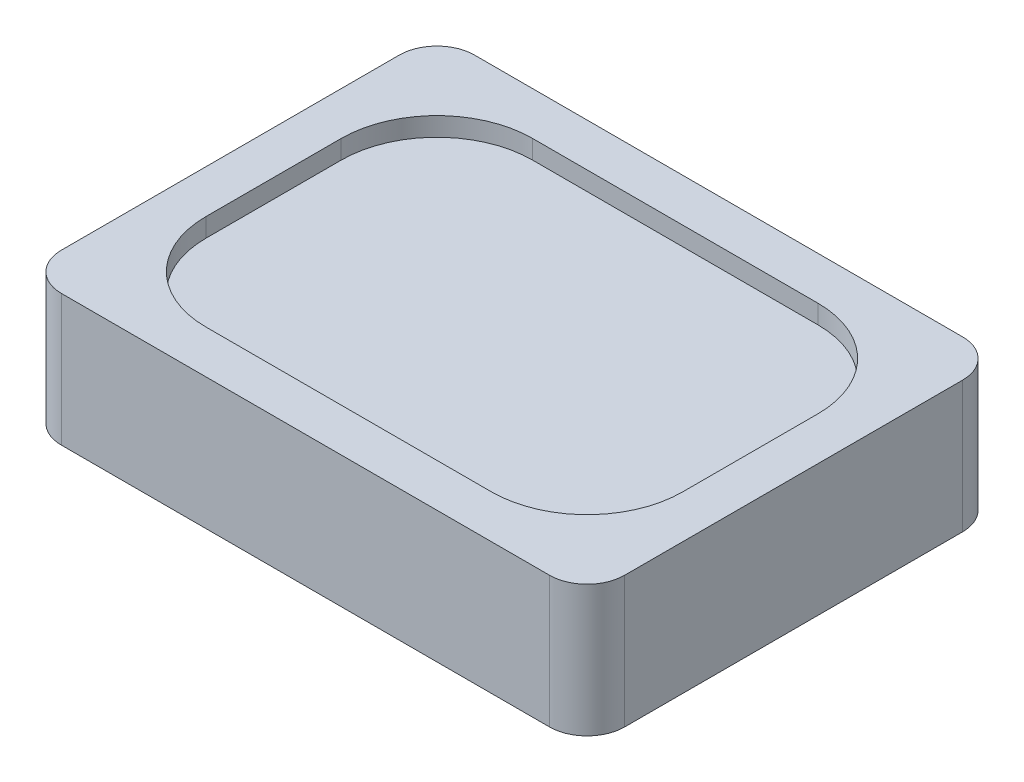
ISO-10303-21;
HEADER;
FILE_DESCRIPTION(('STEP AP214'),'2;1');
FILE_NAME('part.step','',(''),(''),'','','');
FILE_SCHEMA(('AUTOMOTIVE_DESIGN { 1 0 10303 214 1 1 1 1 }'));
ENDSEC;
DATA;
#1=APPLICATION_CONTEXT('core data for automotive mechanical design processes');
#2=APPLICATION_PROTOCOL_DEFINITION('international standard','automotive_design',2000,#1);
#3=PRODUCT_CONTEXT('',#1,'mechanical');
#4=PRODUCT('Part','Part','',(#3));
#5=PRODUCT_RELATED_PRODUCT_CATEGORY('part','',(#4));
#6=PRODUCT_DEFINITION_FORMATION('','',#4);
#7=PRODUCT_DEFINITION_CONTEXT('part definition',#1,'design');
#8=PRODUCT_DEFINITION('design','',#6,#7);
#9=PRODUCT_DEFINITION_SHAPE('','',#8);
#10=(LENGTH_UNIT() NAMED_UNIT(*) SI_UNIT(.MILLI.,.METRE.));
#11=(NAMED_UNIT(*) PLANE_ANGLE_UNIT() SI_UNIT($,.RADIAN.));
#12=(NAMED_UNIT(*) SI_UNIT($,.STERADIAN.) SOLID_ANGLE_UNIT());
#13=UNCERTAINTY_MEASURE_WITH_UNIT(LENGTH_MEASURE(1.E-05),#10,'distance_accuracy_value','');
#14=(GEOMETRIC_REPRESENTATION_CONTEXT(3) GLOBAL_UNCERTAINTY_ASSIGNED_CONTEXT((#13)) GLOBAL_UNIT_ASSIGNED_CONTEXT((#10,
#11,#12)) REPRESENTATION_CONTEXT('',''));
#15=CARTESIAN_POINT('',(0.,0.,0.));
#16=DIRECTION('',(0.,0.,1.));
#17=DIRECTION('',(1.,0.,0.));
#18=AXIS2_PLACEMENT_3D('',#15,#16,#17);
#19=CARTESIAN_POINT('',(7.5,3.5,5.50000000000001));
#20=DIRECTION('',(-1.,0.,0.));
#21=DIRECTION('',(0.,0.,1.));
#22=AXIS2_PLACEMENT_3D('',#19,#20,#21);
#23=PLANE('',#22);
#24=DIRECTION('',(0.,0.,-1.));
#25=VECTOR('',#24,1.);
#26=CARTESIAN_POINT('',(7.5,0.,5.50000000000001));
#27=LINE('',#26,#25);
#28=CARTESIAN_POINT('',(7.5,0.,4.50000000000001));
#29=VERTEX_POINT('',#28);
#30=CARTESIAN_POINT('',(7.5,0.,-4.49999999999999));
#31=VERTEX_POINT('',#30);
#32=EDGE_CURVE('E177',#29,#31,#27,.T.);
#33=ORIENTED_EDGE('',*,*,#32,.T.);
#34=DIRECTION('',(0.,-1.,0.));
#35=VECTOR('',#34,1.);
#36=CARTESIAN_POINT('',(7.5,3.5,-4.49999999999999));
#37=LINE('',#36,#35);
#38=CARTESIAN_POINT('',(7.5,3.5,-4.49999999999999));
#39=VERTEX_POINT('',#38);
#40=EDGE_CURVE('E201',#31,#39,#37,.F.);
#41=ORIENTED_EDGE('',*,*,#40,.T.);
#42=DIRECTION('',(0.,0.,-1.));
#43=VECTOR('',#42,1.);
#44=CARTESIAN_POINT('',(7.5,3.5,5.50000000000001));
#45=LINE('',#44,#43);
#46=CARTESIAN_POINT('',(7.5,3.5,4.50000000000001));
#47=VERTEX_POINT('',#46);
#48=EDGE_CURVE('E175',#47,#39,#45,.T.);
#49=ORIENTED_EDGE('',*,*,#48,.F.);
#50=DIRECTION('',(0.,-1.,0.));
#51=VECTOR('',#50,1.);
#52=CARTESIAN_POINT('',(7.5,3.5,4.50000000000001));
#53=LINE('',#52,#51);
#54=EDGE_CURVE('E198',#47,#29,#53,.T.);
#55=ORIENTED_EDGE('',*,*,#54,.T.);
#56=EDGE_LOOP('',(#33,#41,#49,#55));
#57=FACE_BOUND('',#56,.T.);
#58=ADVANCED_FACE('F33',(#57),#23,.F.);
#59=CARTESIAN_POINT('',(-7.5,3.5,-5.49999999999999));
#60=DIRECTION('',(0.,0.,1.));
#61=DIRECTION('',(1.,0.,0.));
#62=AXIS2_PLACEMENT_3D('',#59,#60,#61);
#63=PLANE('',#62);
#64=DIRECTION('',(-1.,0.,0.));
#65=VECTOR('',#64,1.);
#66=CARTESIAN_POINT('',(-7.5,0.,-5.49999999999999));
#67=LINE('',#66,#65);
#68=CARTESIAN_POINT('',(6.5,0.,-5.49999999999999));
#69=VERTEX_POINT('',#68);
#70=CARTESIAN_POINT('',(-6.5,0.,-5.49999999999999));
#71=VERTEX_POINT('',#70);
#72=EDGE_CURVE('E172',#69,#71,#67,.T.);
#73=ORIENTED_EDGE('',*,*,#72,.T.);
#74=DIRECTION('',(0.,-1.,0.));
#75=VECTOR('',#74,1.);
#76=CARTESIAN_POINT('',(-6.5,3.5,-5.49999999999999));
#77=LINE('',#76,#75);
#78=CARTESIAN_POINT('',(-6.5,3.5,-5.49999999999999));
#79=VERTEX_POINT('',#78);
#80=EDGE_CURVE('E150',#71,#79,#77,.F.);
#81=ORIENTED_EDGE('',*,*,#80,.T.);
#82=DIRECTION('',(-1.,0.,0.));
#83=VECTOR('',#82,1.);
#84=CARTESIAN_POINT('',(-7.5,3.5,-5.49999999999999));
#85=LINE('',#84,#83);
#86=CARTESIAN_POINT('',(6.5,3.5,-5.49999999999999));
#87=VERTEX_POINT('',#86);
#88=EDGE_CURVE('E281',#87,#79,#85,.T.);
#89=ORIENTED_EDGE('',*,*,#88,.F.);
#90=DIRECTION('',(0.,-1.,0.));
#91=VECTOR('',#90,1.);
#92=CARTESIAN_POINT('',(6.5,3.5,-5.49999999999999));
#93=LINE('',#92,#91);
#94=EDGE_CURVE('E155',#87,#69,#93,.T.);
#95=ORIENTED_EDGE('',*,*,#94,.T.);
#96=EDGE_LOOP('',(#73,#81,#89,#95));
#97=FACE_BOUND('',#96,.T.);
#98=ADVANCED_FACE('F305',(#97),#63,.F.);
#99=CARTESIAN_POINT('',(-7.5,3.5,5.50000000000001));
#100=DIRECTION('',(1.,0.,0.));
#101=DIRECTION('',(0.,0.,-1.));
#102=AXIS2_PLACEMENT_3D('',#99,#100,#101);
#103=PLANE('',#102);
#104=DIRECTION('',(0.,0.,1.));
#105=VECTOR('',#104,1.);
#106=CARTESIAN_POINT('',(-7.5,3.5,5.50000000000001));
#107=LINE('',#106,#105);
#108=CARTESIAN_POINT('',(-7.5,3.5,-4.49999999999999));
#109=VERTEX_POINT('',#108);
#110=CARTESIAN_POINT('',(-7.5,3.5,4.50000000000001));
#111=VERTEX_POINT('',#110);
#112=EDGE_CURVE('E165',#109,#111,#107,.T.);
#113=ORIENTED_EDGE('',*,*,#112,.F.);
#114=DIRECTION('',(0.,-1.,0.));
#115=VECTOR('',#114,1.);
#116=CARTESIAN_POINT('',(-7.5,3.5,-4.49999999999999));
#117=LINE('',#116,#115);
#118=CARTESIAN_POINT('',(-7.5,0.,-4.49999999999999));
#119=VERTEX_POINT('',#118);
#120=EDGE_CURVE('E149',#109,#119,#117,.T.);
#121=ORIENTED_EDGE('',*,*,#120,.T.);
#122=DIRECTION('',(0.,0.,1.));
#123=VECTOR('',#122,1.);
#124=CARTESIAN_POINT('',(-7.5,0.,5.50000000000001));
#125=LINE('',#124,#123);
#126=CARTESIAN_POINT('',(-7.5,0.,4.50000000000001));
#127=VERTEX_POINT('',#126);
#128=EDGE_CURVE('E162',#119,#127,#125,.T.);
#129=ORIENTED_EDGE('',*,*,#128,.T.);
#130=DIRECTION('',(0.,-1.,0.));
#131=VECTOR('',#130,1.);
#132=CARTESIAN_POINT('',(-7.5,3.5,4.50000000000001));
#133=LINE('',#132,#131);
#134=EDGE_CURVE('E167',#127,#111,#133,.F.);
#135=ORIENTED_EDGE('',*,*,#134,.T.);
#136=EDGE_LOOP('',(#113,#121,#129,#135));
#137=FACE_BOUND('',#136,.T.);
#138=ADVANCED_FACE('F161',(#137),#103,.F.);
#139=CARTESIAN_POINT('',(-7.5,3.5,5.50000000000001));
#140=DIRECTION('',(0.,0.,-1.));
#141=DIRECTION('',(-1.,0.,0.));
#142=AXIS2_PLACEMENT_3D('',#139,#140,#141);
#143=PLANE('',#142);
#144=DIRECTION('',(1.,0.,0.));
#145=VECTOR('',#144,1.);
#146=CARTESIAN_POINT('',(-7.5,0.,5.50000000000001));
#147=LINE('',#146,#145);
#148=CARTESIAN_POINT('',(-6.5,0.,5.50000000000001));
#149=VERTEX_POINT('',#148);
#150=CARTESIAN_POINT('',(6.5,0.,5.50000000000001));
#151=VERTEX_POINT('',#150);
#152=EDGE_CURVE('E171',#149,#151,#147,.T.);
#153=ORIENTED_EDGE('',*,*,#152,.T.);
#154=DIRECTION('',(0.,-1.,0.));
#155=VECTOR('',#154,1.);
#156=CARTESIAN_POINT('',(6.5,3.5,5.50000000000001));
#157=LINE('',#156,#155);
#158=CARTESIAN_POINT('',(6.5,3.5,5.50000000000001));
#159=VERTEX_POINT('',#158);
#160=EDGE_CURVE('E206',#151,#159,#157,.F.);
#161=ORIENTED_EDGE('',*,*,#160,.T.);
#162=DIRECTION('',(1.,0.,0.));
#163=VECTOR('',#162,1.);
#164=CARTESIAN_POINT('',(-7.5,3.5,5.50000000000001));
#165=LINE('',#164,#163);
#166=CARTESIAN_POINT('',(-6.5,3.5,5.50000000000001));
#167=VERTEX_POINT('',#166);
#168=EDGE_CURVE('E181',#167,#159,#165,.T.);
#169=ORIENTED_EDGE('',*,*,#168,.F.);
#170=DIRECTION('',(0.,-1.,0.));
#171=VECTOR('',#170,1.);
#172=CARTESIAN_POINT('',(-6.5,3.5,5.50000000000001));
#173=LINE('',#172,#171);
#174=EDGE_CURVE('E203',#167,#149,#173,.T.);
#175=ORIENTED_EDGE('',*,*,#174,.T.);
#176=EDGE_LOOP('',(#153,#161,#169,#175));
#177=FACE_BOUND('',#176,.T.);
#178=ADVANCED_FACE('F308',(#177),#143,.F.);
#179=CARTESIAN_POINT('',(0.,3.5,0.));
#180=DIRECTION('',(0.,-1.,0.));
#181=DIRECTION('',(0.,0.,-1.));
#182=AXIS2_PLACEMENT_3D('',#179,#180,#181);
#183=PLANE('',#182);
#184=DIRECTION('',(-1.,0.,0.));
#185=VECTOR('',#184,1.);
#186=CARTESIAN_POINT('',(-6.35,3.5,-4.35));
#187=LINE('',#186,#185);
#188=CARTESIAN_POINT('',(3.8,3.5,-4.35));
#189=VERTEX_POINT('',#188);
#190=CARTESIAN_POINT('',(-3.8,3.5,-4.35));
#191=VERTEX_POINT('',#190);
#192=EDGE_CURVE('E253',#189,#191,#187,.T.);
#193=ORIENTED_EDGE('',*,*,#192,.F.);
#194=CARTESIAN_POINT('',(3.8,3.5,-1.8));
#195=DIRECTION('',(0.,-1.,0.));
#196=DIRECTION('',(0.,0.,-1.));
#197=AXIS2_PLACEMENT_3D('',#194,#195,#196);
#198=CIRCLE('',#197,2.55);
#199=CARTESIAN_POINT('',(6.35,3.5,-1.8));
#200=VERTEX_POINT('',#199);
#201=EDGE_CURVE('E11',#189,#200,#198,.T.);
#202=ORIENTED_EDGE('',*,*,#201,.T.);
#203=DIRECTION('',(0.,0.,-1.));
#204=VECTOR('',#203,1.);
#205=CARTESIAN_POINT('',(6.35,3.5,4.35));
#206=LINE('',#205,#204);
#207=CARTESIAN_POINT('',(6.35,3.5,1.8));
#208=VERTEX_POINT('',#207);
#209=EDGE_CURVE('E273',#208,#200,#206,.T.);
#210=ORIENTED_EDGE('',*,*,#209,.F.);
#211=CARTESIAN_POINT('',(3.8,3.5,1.8));
#212=DIRECTION('',(0.,-1.,0.));
#213=DIRECTION('',(0.,0.,-1.));
#214=AXIS2_PLACEMENT_3D('',#211,#212,#213);
#215=CIRCLE('',#214,2.55);
#216=CARTESIAN_POINT('',(3.8,3.5,4.35));
#217=VERTEX_POINT('',#216);
#218=EDGE_CURVE('E235',#208,#217,#215,.T.);
#219=ORIENTED_EDGE('',*,*,#218,.T.);
#220=DIRECTION('',(1.,0.,0.));
#221=VECTOR('',#220,1.);
#222=CARTESIAN_POINT('',(-6.35,3.5,4.35));
#223=LINE('',#222,#221);
#224=CARTESIAN_POINT('',(-3.8,3.5,4.35));
#225=VERTEX_POINT('',#224);
#226=EDGE_CURVE('E244',#225,#217,#223,.T.);
#227=ORIENTED_EDGE('',*,*,#226,.F.);
#228=CARTESIAN_POINT('',(-3.8,3.5,1.8));
#229=DIRECTION('',(0.,-1.,0.));
#230=DIRECTION('',(0.,0.,-1.));
#231=AXIS2_PLACEMENT_3D('',#228,#229,#230);
#232=CIRCLE('',#231,2.55);
#233=CARTESIAN_POINT('',(-6.35,3.5,1.8));
#234=VERTEX_POINT('',#233);
#235=EDGE_CURVE('E237',#225,#234,#232,.T.);
#236=ORIENTED_EDGE('',*,*,#235,.T.);
#237=DIRECTION('',(0.,0.,1.));
#238=VECTOR('',#237,1.);
#239=CARTESIAN_POINT('',(-6.35,3.5,4.35));
#240=LINE('',#239,#238);
#241=CARTESIAN_POINT('',(-6.35,3.5,-1.8));
#242=VERTEX_POINT('',#241);
#243=EDGE_CURVE('E242',#242,#234,#240,.T.);
#244=ORIENTED_EDGE('',*,*,#243,.F.);
#245=CARTESIAN_POINT('',(-3.8,3.5,-1.8));
#246=DIRECTION('',(0.,-1.,0.));
#247=DIRECTION('',(0.,0.,-1.));
#248=AXIS2_PLACEMENT_3D('',#245,#246,#247);
#249=CIRCLE('',#248,2.55);
#250=EDGE_CURVE('E41',#242,#191,#249,.T.);
#251=ORIENTED_EDGE('',*,*,#250,.T.);
#252=EDGE_LOOP('',(#193,#202,#210,#219,#227,#236,#244,#251));
#253=FACE_BOUND('',#252,.T.);
#254=ORIENTED_EDGE('',*,*,#88,.T.);
#255=CARTESIAN_POINT('',(-6.5,3.5,-4.49999999999999));
#256=DIRECTION('',(0.,-1.,0.));
#257=DIRECTION('',(0.,0.,-1.));
#258=AXIS2_PLACEMENT_3D('',#255,#256,#257);
#259=CIRCLE('',#258,1.);
#260=EDGE_CURVE('E196',#79,#109,#259,.F.);
#261=ORIENTED_EDGE('',*,*,#260,.T.);
#262=ORIENTED_EDGE('',*,*,#112,.T.);
#263=CARTESIAN_POINT('',(-6.5,3.5,4.50000000000001));
#264=DIRECTION('',(0.,-1.,0.));
#265=DIRECTION('',(0.,0.,-1.));
#266=AXIS2_PLACEMENT_3D('',#263,#264,#265);
#267=CIRCLE('',#266,1.);
#268=EDGE_CURVE('E190',#111,#167,#267,.F.);
#269=ORIENTED_EDGE('',*,*,#268,.T.);
#270=ORIENTED_EDGE('',*,*,#168,.T.);
#271=CARTESIAN_POINT('',(6.5,3.5,4.50000000000001));
#272=DIRECTION('',(0.,-1.,0.));
#273=DIRECTION('',(0.,0.,-1.));
#274=AXIS2_PLACEMENT_3D('',#271,#272,#273);
#275=CIRCLE('',#274,1.);
#276=EDGE_CURVE('E192',#159,#47,#275,.F.);
#277=ORIENTED_EDGE('',*,*,#276,.T.);
#278=ORIENTED_EDGE('',*,*,#48,.T.);
#279=CARTESIAN_POINT('',(6.5,3.5,-4.49999999999999));
#280=DIRECTION('',(0.,-1.,0.));
#281=DIRECTION('',(0.,0.,-1.));
#282=AXIS2_PLACEMENT_3D('',#279,#280,#281);
#283=CIRCLE('',#282,1.);
#284=EDGE_CURVE('E194',#39,#87,#283,.F.);
#285=ORIENTED_EDGE('',*,*,#284,.T.);
#286=EDGE_LOOP('',(#254,#261,#262,#269,#270,#277,#278,#285));
#287=FACE_BOUND('',#286,.T.);
#288=ADVANCED_FACE('F240',(#253,#287),#183,.F.);
#289=CARTESIAN_POINT('',(0.,0.,0.));
#290=DIRECTION('',(0.,-1.,0.));
#291=DIRECTION('',(0.,0.,-1.));
#292=AXIS2_PLACEMENT_3D('',#289,#290,#291);
#293=PLANE('',#292);
#294=ORIENTED_EDGE('',*,*,#128,.F.);
#295=CARTESIAN_POINT('',(-6.5,0.,-4.49999999999999));
#296=DIRECTION('',(0.,-1.,0.));
#297=DIRECTION('',(0.,0.,-1.));
#298=AXIS2_PLACEMENT_3D('',#295,#296,#297);
#299=CIRCLE('',#298,1.);
#300=EDGE_CURVE('E145',#119,#71,#299,.T.);
#301=ORIENTED_EDGE('',*,*,#300,.T.);
#302=ORIENTED_EDGE('',*,*,#72,.F.);
#303=CARTESIAN_POINT('',(6.5,0.,-4.49999999999999));
#304=DIRECTION('',(0.,-1.,0.));
#305=DIRECTION('',(0.,0.,-1.));
#306=AXIS2_PLACEMENT_3D('',#303,#304,#305);
#307=CIRCLE('',#306,1.);
#308=EDGE_CURVE('E156',#69,#31,#307,.T.);
#309=ORIENTED_EDGE('',*,*,#308,.T.);
#310=ORIENTED_EDGE('',*,*,#32,.F.);
#311=CARTESIAN_POINT('',(6.5,0.,4.50000000000001));
#312=DIRECTION('',(0.,-1.,0.));
#313=DIRECTION('',(0.,0.,-1.));
#314=AXIS2_PLACEMENT_3D('',#311,#312,#313);
#315=CIRCLE('',#314,1.);
#316=EDGE_CURVE('E184',#29,#151,#315,.T.);
#317=ORIENTED_EDGE('',*,*,#316,.T.);
#318=ORIENTED_EDGE('',*,*,#152,.F.);
#319=CARTESIAN_POINT('',(-6.5,0.,4.50000000000001));
#320=DIRECTION('',(0.,-1.,0.));
#321=DIRECTION('',(0.,0.,-1.));
#322=AXIS2_PLACEMENT_3D('',#319,#320,#321);
#323=CIRCLE('',#322,1.);
#324=EDGE_CURVE('E166',#149,#127,#323,.T.);
#325=ORIENTED_EDGE('',*,*,#324,.T.);
#326=EDGE_LOOP('',(#294,#301,#302,#309,#310,#317,#318,#325));
#327=FACE_BOUND('',#326,.T.);
#328=ADVANCED_FACE('F169',(#327),#293,.T.);
#329=CARTESIAN_POINT('',(-6.5,3.5,-4.49999999999999));
#330=DIRECTION('',(0.,-1.,0.));
#331=DIRECTION('',(0.,0.,-1.));
#332=AXIS2_PLACEMENT_3D('',#329,#330,#331);
#333=CYLINDRICAL_SURFACE('',#332,1.);
#334=ORIENTED_EDGE('',*,*,#260,.F.);
#335=ORIENTED_EDGE('',*,*,#80,.F.);
#336=ORIENTED_EDGE('',*,*,#300,.F.);
#337=ORIENTED_EDGE('',*,*,#120,.F.);
#338=EDGE_LOOP('',(#334,#335,#336,#337));
#339=FACE_BOUND('',#338,.T.);
#340=ADVANCED_FACE('F148',(#339),#333,.T.);
#341=CARTESIAN_POINT('',(6.5,3.5,-4.49999999999999));
#342=DIRECTION('',(0.,-1.,0.));
#343=DIRECTION('',(0.,0.,-1.));
#344=AXIS2_PLACEMENT_3D('',#341,#342,#343);
#345=CYLINDRICAL_SURFACE('',#344,1.);
#346=ORIENTED_EDGE('',*,*,#284,.F.);
#347=ORIENTED_EDGE('',*,*,#40,.F.);
#348=ORIENTED_EDGE('',*,*,#308,.F.);
#349=ORIENTED_EDGE('',*,*,#94,.F.);
#350=EDGE_LOOP('',(#346,#347,#348,#349));
#351=FACE_BOUND('',#350,.T.);
#352=ADVANCED_FACE('F302',(#351),#345,.T.);
#353=CARTESIAN_POINT('',(6.5,3.5,4.50000000000001));
#354=DIRECTION('',(0.,-1.,0.));
#355=DIRECTION('',(0.,0.,-1.));
#356=AXIS2_PLACEMENT_3D('',#353,#354,#355);
#357=CYLINDRICAL_SURFACE('',#356,1.);
#358=ORIENTED_EDGE('',*,*,#276,.F.);
#359=ORIENTED_EDGE('',*,*,#160,.F.);
#360=ORIENTED_EDGE('',*,*,#316,.F.);
#361=ORIENTED_EDGE('',*,*,#54,.F.);
#362=EDGE_LOOP('',(#358,#359,#360,#361));
#363=FACE_BOUND('',#362,.T.);
#364=ADVANCED_FACE('F295',(#363),#357,.T.);
#365=CARTESIAN_POINT('',(-6.5,3.5,4.50000000000001));
#366=DIRECTION('',(0.,-1.,0.));
#367=DIRECTION('',(0.,0.,-1.));
#368=AXIS2_PLACEMENT_3D('',#365,#366,#367);
#369=CYLINDRICAL_SURFACE('',#368,1.);
#370=ORIENTED_EDGE('',*,*,#268,.F.);
#371=ORIENTED_EDGE('',*,*,#134,.F.);
#372=ORIENTED_EDGE('',*,*,#324,.F.);
#373=ORIENTED_EDGE('',*,*,#174,.F.);
#374=EDGE_LOOP('',(#370,#371,#372,#373));
#375=FACE_BOUND('',#374,.T.);
#376=ADVANCED_FACE('F307',(#375),#369,.T.);
#377=CARTESIAN_POINT('',(6.35,3.,4.35));
#378=DIRECTION('',(1.,0.,0.));
#379=DIRECTION('',(0.,0.,-1.));
#380=AXIS2_PLACEMENT_3D('',#377,#378,#379);
#381=PLANE('',#380);
#382=DIRECTION('',(0.,0.,-1.));
#383=VECTOR('',#382,1.);
#384=CARTESIAN_POINT('',(6.35,3.,4.35));
#385=LINE('',#384,#383);
#386=CARTESIAN_POINT('',(6.35,3.,1.8));
#387=VERTEX_POINT('',#386);
#388=CARTESIAN_POINT('',(6.35,3.,-1.8));
#389=VERTEX_POINT('',#388);
#390=EDGE_CURVE('E278',#387,#389,#385,.T.);
#391=ORIENTED_EDGE('',*,*,#390,.F.);
#392=DIRECTION('',(0.,1.,0.));
#393=VECTOR('',#392,1.);
#394=CARTESIAN_POINT('',(6.35,3.5,1.8));
#395=LINE('',#394,#393);
#396=EDGE_CURVE('E210',#387,#208,#395,.T.);
#397=ORIENTED_EDGE('',*,*,#396,.T.);
#398=ORIENTED_EDGE('',*,*,#209,.T.);
#399=DIRECTION('',(0.,1.,0.));
#400=VECTOR('',#399,1.);
#401=CARTESIAN_POINT('',(6.35,3.,-1.8));
#402=LINE('',#401,#400);
#403=EDGE_CURVE('E208',#200,#389,#402,.F.);
#404=ORIENTED_EDGE('',*,*,#403,.T.);
#405=EDGE_LOOP('',(#391,#397,#398,#404));
#406=FACE_BOUND('',#405,.T.);
#407=ADVANCED_FACE('F333',(#406),#381,.F.);
#408=CARTESIAN_POINT('',(-6.35,3.,4.35));
#409=DIRECTION('',(0.,0.,1.));
#410=DIRECTION('',(1.,0.,0.));
#411=AXIS2_PLACEMENT_3D('',#408,#409,#410);
#412=PLANE('',#411);
#413=ORIENTED_EDGE('',*,*,#226,.T.);
#414=DIRECTION('',(0.,1.,0.));
#415=VECTOR('',#414,1.);
#416=CARTESIAN_POINT('',(3.8,3.,4.35));
#417=LINE('',#416,#415);
#418=CARTESIAN_POINT('',(3.8,3.,4.35));
#419=VERTEX_POINT('',#418);
#420=EDGE_CURVE('E216',#217,#419,#417,.F.);
#421=ORIENTED_EDGE('',*,*,#420,.T.);
#422=DIRECTION('',(1.,0.,0.));
#423=VECTOR('',#422,1.);
#424=CARTESIAN_POINT('',(-6.35,3.,4.35));
#425=LINE('',#424,#423);
#426=CARTESIAN_POINT('',(-3.8,3.,4.35));
#427=VERTEX_POINT('',#426);
#428=EDGE_CURVE('E261',#427,#419,#425,.T.);
#429=ORIENTED_EDGE('',*,*,#428,.F.);
#430=DIRECTION('',(0.,1.,0.));
#431=VECTOR('',#430,1.);
#432=CARTESIAN_POINT('',(-3.8,3.5,4.35));
#433=LINE('',#432,#431);
#434=EDGE_CURVE('E213',#427,#225,#433,.T.);
#435=ORIENTED_EDGE('',*,*,#434,.T.);
#436=EDGE_LOOP('',(#413,#421,#429,#435));
#437=FACE_BOUND('',#436,.T.);
#438=ADVANCED_FACE('F265',(#437),#412,.F.);
#439=CARTESIAN_POINT('',(-6.35,3.,4.35));
#440=DIRECTION('',(-1.,0.,0.));
#441=DIRECTION('',(0.,0.,1.));
#442=AXIS2_PLACEMENT_3D('',#439,#440,#441);
#443=PLANE('',#442);
#444=ORIENTED_EDGE('',*,*,#243,.T.);
#445=DIRECTION('',(0.,1.,0.));
#446=VECTOR('',#445,1.);
#447=CARTESIAN_POINT('',(-6.35,3.,1.8));
#448=LINE('',#447,#446);
#449=CARTESIAN_POINT('',(-6.35,3.,1.8));
#450=VERTEX_POINT('',#449);
#451=EDGE_CURVE('E229',#234,#450,#448,.F.);
#452=ORIENTED_EDGE('',*,*,#451,.T.);
#453=DIRECTION('',(0.,0.,1.));
#454=VECTOR('',#453,1.);
#455=CARTESIAN_POINT('',(-6.35,3.,4.35));
#456=LINE('',#455,#454);
#457=CARTESIAN_POINT('',(-6.35,3.,-1.8));
#458=VERTEX_POINT('',#457);
#459=EDGE_CURVE('E263',#458,#450,#456,.T.);
#460=ORIENTED_EDGE('',*,*,#459,.F.);
#461=DIRECTION('',(0.,1.,0.));
#462=VECTOR('',#461,1.);
#463=CARTESIAN_POINT('',(-6.35,3.5,-1.8));
#464=LINE('',#463,#462);
#465=EDGE_CURVE('E226',#458,#242,#464,.T.);
#466=ORIENTED_EDGE('',*,*,#465,.T.);
#467=EDGE_LOOP('',(#444,#452,#460,#466));
#468=FACE_BOUND('',#467,.T.);
#469=ADVANCED_FACE('F249',(#468),#443,.F.);
#470=CARTESIAN_POINT('',(-6.35,3.,-4.35));
#471=DIRECTION('',(0.,0.,-1.));
#472=DIRECTION('',(-1.,0.,0.));
#473=AXIS2_PLACEMENT_3D('',#470,#471,#472);
#474=PLANE('',#473);
#475=ORIENTED_EDGE('',*,*,#192,.T.);
#476=DIRECTION('',(0.,1.,0.));
#477=VECTOR('',#476,1.);
#478=CARTESIAN_POINT('',(-3.8,3.,-4.35));
#479=LINE('',#478,#477);
#480=CARTESIAN_POINT('',(-3.8,3.,-4.35));
#481=VERTEX_POINT('',#480);
#482=EDGE_CURVE('E233',#191,#481,#479,.F.);
#483=ORIENTED_EDGE('',*,*,#482,.T.);
#484=DIRECTION('',(-1.,0.,0.));
#485=VECTOR('',#484,1.);
#486=CARTESIAN_POINT('',(-6.35,3.,-4.35));
#487=LINE('',#486,#485);
#488=CARTESIAN_POINT('',(3.8,3.,-4.35));
#489=VERTEX_POINT('',#488);
#490=EDGE_CURVE('E269',#489,#481,#487,.T.);
#491=ORIENTED_EDGE('',*,*,#490,.F.);
#492=DIRECTION('',(0.,1.,0.));
#493=VECTOR('',#492,1.);
#494=CARTESIAN_POINT('',(3.8,3.5,-4.35));
#495=LINE('',#494,#493);
#496=EDGE_CURVE('E231',#489,#189,#495,.T.);
#497=ORIENTED_EDGE('',*,*,#496,.T.);
#498=EDGE_LOOP('',(#475,#483,#491,#497));
#499=FACE_BOUND('',#498,.T.);
#500=ADVANCED_FACE('F356',(#499),#474,.F.);
#501=CARTESIAN_POINT('',(0.,3.,0.));
#502=DIRECTION('',(0.,-1.,0.));
#503=DIRECTION('',(0.,0.,-1.));
#504=AXIS2_PLACEMENT_3D('',#501,#502,#503);
#505=PLANE('',#504);
#506=ORIENTED_EDGE('',*,*,#428,.T.);
#507=CARTESIAN_POINT('',(3.8,3.,1.8));
#508=DIRECTION('',(0.,-1.,0.));
#509=DIRECTION('',(0.,0.,-1.));
#510=AXIS2_PLACEMENT_3D('',#507,#508,#509);
#511=CIRCLE('',#510,2.55);
#512=EDGE_CURVE('E224',#419,#387,#511,.F.);
#513=ORIENTED_EDGE('',*,*,#512,.T.);
#514=ORIENTED_EDGE('',*,*,#390,.T.);
#515=CARTESIAN_POINT('',(3.8,3.,-1.8));
#516=DIRECTION('',(0.,-1.,0.));
#517=DIRECTION('',(0.,0.,-1.));
#518=AXIS2_PLACEMENT_3D('',#515,#516,#517);
#519=CIRCLE('',#518,2.55);
#520=EDGE_CURVE('E218',#389,#489,#519,.F.);
#521=ORIENTED_EDGE('',*,*,#520,.T.);
#522=ORIENTED_EDGE('',*,*,#490,.T.);
#523=CARTESIAN_POINT('',(-3.8,3.,-1.8));
#524=DIRECTION('',(0.,-1.,0.));
#525=DIRECTION('',(0.,0.,-1.));
#526=AXIS2_PLACEMENT_3D('',#523,#524,#525);
#527=CIRCLE('',#526,2.55);
#528=EDGE_CURVE('E220',#481,#458,#527,.F.);
#529=ORIENTED_EDGE('',*,*,#528,.T.);
#530=ORIENTED_EDGE('',*,*,#459,.T.);
#531=CARTESIAN_POINT('',(-3.8,3.,1.8));
#532=DIRECTION('',(0.,-1.,0.));
#533=DIRECTION('',(0.,0.,-1.));
#534=AXIS2_PLACEMENT_3D('',#531,#532,#533);
#535=CIRCLE('',#534,2.55);
#536=EDGE_CURVE('E222',#450,#427,#535,.F.);
#537=ORIENTED_EDGE('',*,*,#536,.T.);
#538=EDGE_LOOP('',(#506,#513,#514,#521,#522,#529,#530,#537));
#539=FACE_BOUND('',#538,.T.);
#540=ADVANCED_FACE('F260',(#539),#505,.F.);
#541=CARTESIAN_POINT('',(3.8,3.,1.8));
#542=DIRECTION('',(0.,-1.,0.));
#543=DIRECTION('',(0.,0.,-1.));
#544=AXIS2_PLACEMENT_3D('',#541,#542,#543);
#545=CYLINDRICAL_SURFACE('',#544,2.55);
#546=ORIENTED_EDGE('',*,*,#512,.F.);
#547=ORIENTED_EDGE('',*,*,#420,.F.);
#548=ORIENTED_EDGE('',*,*,#218,.F.);
#549=ORIENTED_EDGE('',*,*,#396,.F.);
#550=EDGE_LOOP('',(#546,#547,#548,#549));
#551=FACE_BOUND('',#550,.T.);
#552=ADVANCED_FACE('F334',(#551),#545,.F.);
#553=CARTESIAN_POINT('',(-3.8,3.,1.8));
#554=DIRECTION('',(0.,-1.,0.));
#555=DIRECTION('',(0.,0.,-1.));
#556=AXIS2_PLACEMENT_3D('',#553,#554,#555);
#557=CYLINDRICAL_SURFACE('',#556,2.55);
#558=ORIENTED_EDGE('',*,*,#536,.F.);
#559=ORIENTED_EDGE('',*,*,#451,.F.);
#560=ORIENTED_EDGE('',*,*,#235,.F.);
#561=ORIENTED_EDGE('',*,*,#434,.F.);
#562=EDGE_LOOP('',(#558,#559,#560,#561));
#563=FACE_BOUND('',#562,.T.);
#564=ADVANCED_FACE('F256',(#563),#557,.F.);
#565=CARTESIAN_POINT('',(-3.8,3.,-1.8));
#566=DIRECTION('',(0.,-1.,0.));
#567=DIRECTION('',(0.,0.,-1.));
#568=AXIS2_PLACEMENT_3D('',#565,#566,#567);
#569=CYLINDRICAL_SURFACE('',#568,2.55);
#570=ORIENTED_EDGE('',*,*,#528,.F.);
#571=ORIENTED_EDGE('',*,*,#482,.F.);
#572=ORIENTED_EDGE('',*,*,#250,.F.);
#573=ORIENTED_EDGE('',*,*,#465,.F.);
#574=EDGE_LOOP('',(#570,#571,#572,#573));
#575=FACE_BOUND('',#574,.T.);
#576=ADVANCED_FACE('F339',(#575),#569,.F.);
#577=CARTESIAN_POINT('',(3.8,3.,-1.8));
#578=DIRECTION('',(0.,-1.,0.));
#579=DIRECTION('',(0.,0.,-1.));
#580=AXIS2_PLACEMENT_3D('',#577,#578,#579);
#581=CYLINDRICAL_SURFACE('',#580,2.55);
#582=ORIENTED_EDGE('',*,*,#520,.F.);
#583=ORIENTED_EDGE('',*,*,#403,.F.);
#584=ORIENTED_EDGE('',*,*,#201,.F.);
#585=ORIENTED_EDGE('',*,*,#496,.F.);
#586=EDGE_LOOP('',(#582,#583,#584,#585));
#587=FACE_BOUND('',#586,.T.);
#588=ADVANCED_FACE('F35',(#587),#581,.F.);
#589=CLOSED_SHELL('',(#58,#98,#138,#178,#288,#328,#340,#352,#364,#376,#407,#438,#469,#500,#540,
#552,#564,#576,#588));
#590=MANIFOLD_SOLID_BREP('B2',#589);
#591=ADVANCED_BREP_SHAPE_REPRESENTATION('',(#18,#590),#14);
#592=SHAPE_DEFINITION_REPRESENTATION(#9,#591);
ENDSEC;
END-ISO-10303-21;
